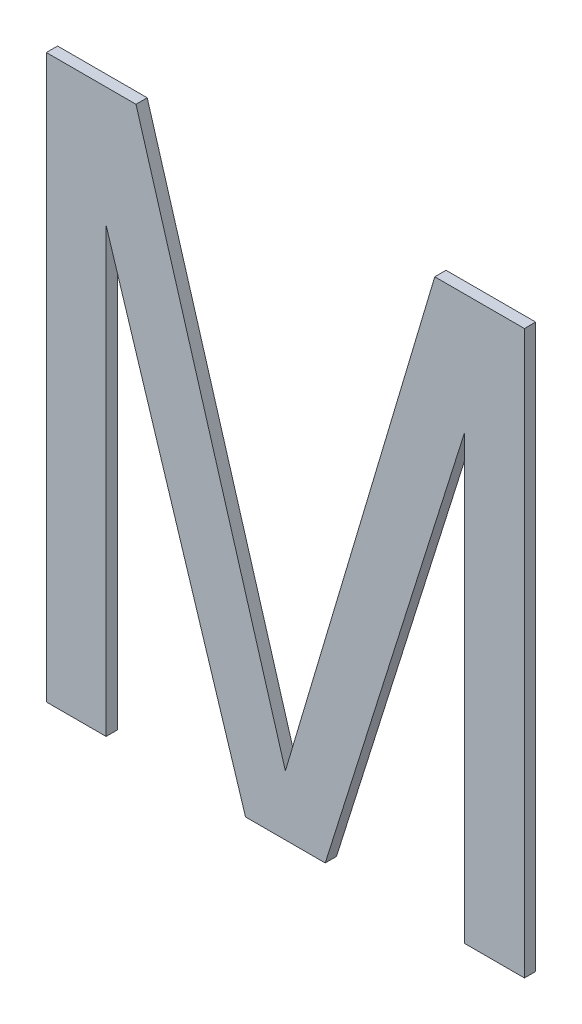
ISO-10303-21;
HEADER;
FILE_DESCRIPTION(('STEP AP214'),'2;1');
FILE_NAME('part.step','',(''),(''),'','','');
FILE_SCHEMA(('AUTOMOTIVE_DESIGN { 1 0 10303 214 1 1 1 1 }'));
ENDSEC;
DATA;
#1=APPLICATION_CONTEXT('core data for automotive mechanical design processes');
#2=APPLICATION_PROTOCOL_DEFINITION('international standard','automotive_design',2000,#1);
#3=PRODUCT_CONTEXT('',#1,'mechanical');
#4=PRODUCT('Part','Part','',(#3));
#5=PRODUCT_RELATED_PRODUCT_CATEGORY('part','',(#4));
#6=PRODUCT_DEFINITION_FORMATION('','',#4);
#7=PRODUCT_DEFINITION_CONTEXT('part definition',#1,'design');
#8=PRODUCT_DEFINITION('design','',#6,#7);
#9=PRODUCT_DEFINITION_SHAPE('','',#8);
#10=(LENGTH_UNIT() NAMED_UNIT(*) SI_UNIT(.MILLI.,.METRE.));
#11=(NAMED_UNIT(*) PLANE_ANGLE_UNIT() SI_UNIT($,.RADIAN.));
#12=(NAMED_UNIT(*) SI_UNIT($,.STERADIAN.) SOLID_ANGLE_UNIT());
#13=UNCERTAINTY_MEASURE_WITH_UNIT(LENGTH_MEASURE(1.E-05),#10,'distance_accuracy_value','');
#14=(GEOMETRIC_REPRESENTATION_CONTEXT(3) GLOBAL_UNCERTAINTY_ASSIGNED_CONTEXT((#13)) GLOBAL_UNIT_ASSIGNED_CONTEXT((#10,
#11,#12)) REPRESENTATION_CONTEXT('',''));
#15=CARTESIAN_POINT('',(0.,0.,0.));
#16=DIRECTION('',(0.,0.,1.));
#17=DIRECTION('',(1.,0.,0.));
#18=AXIS2_PLACEMENT_3D('',#15,#16,#17);
#19=CARTESIAN_POINT('',(179.345164575803,142.200586634191,5.9));
#20=DIRECTION('',(0.,0.,1.));
#21=DIRECTION('',(1.,0.,0.));
#22=AXIS2_PLACEMENT_3D('',#19,#20,#21);
#23=PLANE('',#22);
#24=DIRECTION('',(1.,0.,0.));
#25=VECTOR('',#24,1.);
#26=CARTESIAN_POINT('',(179.345164575803,147.200586634191,5.9));
#27=LINE('',#26,#25);
#28=CARTESIAN_POINT('',(180.142039575803,147.200586634191,5.9));
#29=VERTEX_POINT('',#28);
#30=CARTESIAN_POINT('',(179.345164575803,147.200586634191,5.9));
#31=VERTEX_POINT('',#30);
#32=EDGE_CURVE('E20',#29,#31,#27,.F.);
#33=ORIENTED_EDGE('',*,*,#32,.F.);
#34=DIRECTION('',(0.28492599218727,-0.958549518270235,0.));
#35=VECTOR('',#34,1.);
#36=CARTESIAN_POINT('',(181.470164575803,142.732501538901,5.9));
#37=LINE('',#36,#35);
#38=CARTESIAN_POINT('',(181.470164575803,142.732501538901,5.9));
#39=VERTEX_POINT('',#38);
#40=EDGE_CURVE('E177',#29,#39,#37,.T.);
#41=ORIENTED_EDGE('',*,*,#40,.T.);
#42=DIRECTION('',(0.28492599218727,0.958549518270235,0.));
#43=VECTOR('',#42,1.);
#44=CARTESIAN_POINT('',(182.798289575803,147.200586634191,5.9));
#45=LINE('',#44,#43);
#46=CARTESIAN_POINT('',(182.798289575803,147.200586634191,5.9));
#47=VERTEX_POINT('',#46);
#48=EDGE_CURVE('E172',#39,#47,#45,.T.);
#49=ORIENTED_EDGE('',*,*,#48,.T.);
#50=DIRECTION('',(1.,0.,0.));
#51=VECTOR('',#50,1.);
#52=CARTESIAN_POINT('',(183.595164575803,147.200586634191,5.9));
#53=LINE('',#52,#51);
#54=CARTESIAN_POINT('',(183.595164575803,147.200586634191,5.9));
#55=VERTEX_POINT('',#54);
#56=EDGE_CURVE('E167',#47,#55,#53,.T.);
#57=ORIENTED_EDGE('',*,*,#56,.T.);
#58=DIRECTION('',(0.,1.,0.));
#59=VECTOR('',#58,1.);
#60=CARTESIAN_POINT('',(183.595164575803,142.200586634191,5.9));
#61=LINE('',#60,#59);
#62=CARTESIAN_POINT('',(183.595164575803,142.200586634191,5.9));
#63=VERTEX_POINT('',#62);
#64=EDGE_CURVE('E162',#55,#63,#61,.F.);
#65=ORIENTED_EDGE('',*,*,#64,.T.);
#66=DIRECTION('',(1.,0.,0.));
#67=VECTOR('',#66,1.);
#68=CARTESIAN_POINT('',(183.063914575803,142.200586634191,5.9));
#69=LINE('',#68,#67);
#70=CARTESIAN_POINT('',(183.063914575803,142.200586634191,5.9));
#71=VERTEX_POINT('',#70);
#72=EDGE_CURVE('E157',#63,#71,#69,.F.);
#73=ORIENTED_EDGE('',*,*,#72,.T.);
#74=DIRECTION('',(0.,1.,0.));
#75=VECTOR('',#74,1.);
#76=CARTESIAN_POINT('',(183.063914575803,146.136756973771,5.9));
#77=LINE('',#76,#75);
#78=CARTESIAN_POINT('',(183.063914575803,146.136756973771,5.9));
#79=VERTEX_POINT('',#78);
#80=EDGE_CURVE('E152',#71,#79,#77,.T.);
#81=ORIENTED_EDGE('',*,*,#80,.T.);
#82=DIRECTION('',(-0.300378460265022,-0.953820098660547,0.));
#83=VECTOR('',#82,1.);
#84=CARTESIAN_POINT('',(181.824329891433,142.200586634191,5.9));
#85=LINE('',#84,#83);
#86=CARTESIAN_POINT('',(181.824329891433,142.200586634191,5.9));
#87=VERTEX_POINT('',#86);
#88=EDGE_CURVE('E147',#79,#87,#85,.T.);
#89=ORIENTED_EDGE('',*,*,#88,.T.);
#90=DIRECTION('',(1.,0.,0.));
#91=VECTOR('',#90,1.);
#92=CARTESIAN_POINT('',(181.115999260173,142.200586634191,5.9));
#93=LINE('',#92,#91);
#94=CARTESIAN_POINT('',(181.115999260173,142.200586634191,5.9));
#95=VERTEX_POINT('',#94);
#96=EDGE_CURVE('E142',#87,#95,#93,.F.);
#97=ORIENTED_EDGE('',*,*,#96,.T.);
#98=DIRECTION('',(-0.300378460265025,0.953820098660546,0.));
#99=VECTOR('',#98,1.);
#100=CARTESIAN_POINT('',(179.876414575803,146.136756973771,5.9));
#101=LINE('',#100,#99);
#102=CARTESIAN_POINT('',(179.876414575803,146.136756973771,5.9));
#103=VERTEX_POINT('',#102);
#104=EDGE_CURVE('E138',#95,#103,#101,.T.);
#105=ORIENTED_EDGE('',*,*,#104,.T.);
#106=DIRECTION('',(0.,1.,0.));
#107=VECTOR('',#106,1.);
#108=CARTESIAN_POINT('',(179.876414575803,142.200586634191,5.9));
#109=LINE('',#108,#107);
#110=CARTESIAN_POINT('',(179.876414575803,142.200586634191,5.9));
#111=VERTEX_POINT('',#110);
#112=EDGE_CURVE('E124',#103,#111,#109,.F.);
#113=ORIENTED_EDGE('',*,*,#112,.T.);
#114=DIRECTION('',(1.,0.,0.));
#115=VECTOR('',#114,1.);
#116=CARTESIAN_POINT('',(179.345164575803,142.200586634191,5.9));
#117=LINE('',#116,#115);
#118=CARTESIAN_POINT('',(179.345164575803,142.200586634191,5.9));
#119=VERTEX_POINT('',#118);
#120=EDGE_CURVE('E110',#111,#119,#117,.F.);
#121=ORIENTED_EDGE('',*,*,#120,.T.);
#122=DIRECTION('',(0.,1.,0.));
#123=VECTOR('',#122,1.);
#124=CARTESIAN_POINT('',(179.345164575803,147.200586634191,5.9));
#125=LINE('',#124,#123);
#126=EDGE_CURVE('E116',#119,#31,#125,.T.);
#127=ORIENTED_EDGE('',*,*,#126,.T.);
#128=EDGE_LOOP('',(#33,#41,#49,#57,#65,#73,#81,#89,#97,#105,#113,#121,#127));
#129=FACE_BOUND('',#128,.T.);
#130=ADVANCED_FACE('F17',(#129),#23,.F.);
#131=CARTESIAN_POINT('',(179.345164575803,147.200586634191,6.));
#132=DIRECTION('',(1.,0.,0.));
#133=DIRECTION('',(0.,0.,-1.));
#134=AXIS2_PLACEMENT_3D('',#131,#132,#133);
#135=PLANE('',#134);
#136=DIRECTION('',(0.,0.,1.));
#137=VECTOR('',#136,1.);
#138=CARTESIAN_POINT('',(179.345164575803,142.200586634191,6.));
#139=LINE('',#138,#137);
#140=CARTESIAN_POINT('',(179.345164575803,142.200586634191,6.));
#141=VERTEX_POINT('',#140);
#142=EDGE_CURVE('E118',#119,#141,#139,.T.);
#143=ORIENTED_EDGE('',*,*,#142,.T.);
#144=DIRECTION('',(0.,1.,0.));
#145=VECTOR('',#144,1.);
#146=CARTESIAN_POINT('',(179.345164575803,142.200586634191,6.));
#147=LINE('',#146,#145);
#148=CARTESIAN_POINT('',(179.345164575803,147.200586634191,6.));
#149=VERTEX_POINT('',#148);
#150=EDGE_CURVE('E182',#149,#141,#147,.F.);
#151=ORIENTED_EDGE('',*,*,#150,.F.);
#152=DIRECTION('',(0.,0.,-1.));
#153=VECTOR('',#152,1.);
#154=CARTESIAN_POINT('',(179.345164575803,147.200586634191,6.));
#155=LINE('',#154,#153);
#156=EDGE_CURVE('E121',#149,#31,#155,.T.);
#157=ORIENTED_EDGE('',*,*,#156,.T.);
#158=ORIENTED_EDGE('',*,*,#126,.F.);
#159=EDGE_LOOP('',(#143,#151,#157,#158));
#160=FACE_BOUND('',#159,.T.);
#161=ADVANCED_FACE('F117',(#160),#135,.F.);
#162=CARTESIAN_POINT('',(179.345164575803,142.200586634191,6.));
#163=DIRECTION('',(0.,1.,0.));
#164=DIRECTION('',(0.,0.,1.));
#165=AXIS2_PLACEMENT_3D('',#162,#163,#164);
#166=PLANE('',#165);
#167=DIRECTION('',(0.,0.,1.));
#168=VECTOR('',#167,1.);
#169=CARTESIAN_POINT('',(179.876414575803,142.200586634191,6.));
#170=LINE('',#169,#168);
#171=CARTESIAN_POINT('',(179.876414575803,142.200586634191,6.));
#172=VERTEX_POINT('',#171);
#173=EDGE_CURVE('E126',#111,#172,#170,.T.);
#174=ORIENTED_EDGE('',*,*,#173,.T.);
#175=DIRECTION('',(1.,0.,0.));
#176=VECTOR('',#175,1.);
#177=CARTESIAN_POINT('',(179.345164575803,142.200586634191,6.));
#178=LINE('',#177,#176);
#179=EDGE_CURVE('E130',#141,#172,#178,.T.);
#180=ORIENTED_EDGE('',*,*,#179,.F.);
#181=ORIENTED_EDGE('',*,*,#142,.F.);
#182=ORIENTED_EDGE('',*,*,#120,.F.);
#183=EDGE_LOOP('',(#174,#180,#181,#182));
#184=FACE_BOUND('',#183,.T.);
#185=ADVANCED_FACE('F128',(#184),#166,.F.);
#186=CARTESIAN_POINT('',(179.876414575803,142.200586634191,6.));
#187=DIRECTION('',(-1.,0.,0.));
#188=DIRECTION('',(0.,0.,1.));
#189=AXIS2_PLACEMENT_3D('',#186,#187,#188);
#190=PLANE('',#189);
#191=DIRECTION('',(0.,0.,1.));
#192=VECTOR('',#191,1.);
#193=CARTESIAN_POINT('',(179.876414575803,146.136756973771,6.));
#194=LINE('',#193,#192);
#195=CARTESIAN_POINT('',(179.876414575803,146.136756973771,6.));
#196=VERTEX_POINT('',#195);
#197=EDGE_CURVE('E136',#103,#196,#194,.T.);
#198=ORIENTED_EDGE('',*,*,#197,.T.);
#199=DIRECTION('',(0.,1.,0.));
#200=VECTOR('',#199,1.);
#201=CARTESIAN_POINT('',(179.876414575803,142.200586634191,6.));
#202=LINE('',#201,#200);
#203=EDGE_CURVE('E185',#172,#196,#202,.T.);
#204=ORIENTED_EDGE('',*,*,#203,.F.);
#205=ORIENTED_EDGE('',*,*,#173,.F.);
#206=ORIENTED_EDGE('',*,*,#112,.F.);
#207=EDGE_LOOP('',(#198,#204,#205,#206));
#208=FACE_BOUND('',#207,.T.);
#209=ADVANCED_FACE('F262',(#208),#190,.F.);
#210=CARTESIAN_POINT('',(179.876414575803,146.136756973771,6.));
#211=DIRECTION('',(0.953820098660546,0.300378460265025,0.));
#212=DIRECTION('',(-0.300378460265025,0.953820098660546,0.));
#213=AXIS2_PLACEMENT_3D('',#210,#211,#212);
#214=PLANE('',#213);
#215=DIRECTION('',(0.,0.,1.));
#216=VECTOR('',#215,1.);
#217=CARTESIAN_POINT('',(181.115999260173,142.200586634191,6.));
#218=LINE('',#217,#216);
#219=CARTESIAN_POINT('',(181.115999260173,142.200586634191,6.));
#220=VERTEX_POINT('',#219);
#221=EDGE_CURVE('E140',#95,#220,#218,.T.);
#222=ORIENTED_EDGE('',*,*,#221,.T.);
#223=DIRECTION('',(0.300378460265023,-0.953820098660546,0.));
#224=VECTOR('',#223,1.);
#225=CARTESIAN_POINT('',(179.876414575803,146.136756973771,6.));
#226=LINE('',#225,#224);
#227=EDGE_CURVE('E188',#196,#220,#226,.T.);
#228=ORIENTED_EDGE('',*,*,#227,.F.);
#229=ORIENTED_EDGE('',*,*,#197,.F.);
#230=ORIENTED_EDGE('',*,*,#104,.F.);
#231=EDGE_LOOP('',(#222,#228,#229,#230));
#232=FACE_BOUND('',#231,.T.);
#233=ADVANCED_FACE('F258',(#232),#214,.F.);
#234=CARTESIAN_POINT('',(181.115999260173,142.200586634191,6.));
#235=DIRECTION('',(0.,1.,0.));
#236=DIRECTION('',(0.,0.,1.));
#237=AXIS2_PLACEMENT_3D('',#234,#235,#236);
#238=PLANE('',#237);
#239=DIRECTION('',(0.,0.,1.));
#240=VECTOR('',#239,1.);
#241=CARTESIAN_POINT('',(181.824329891433,142.200586634191,6.));
#242=LINE('',#241,#240);
#243=CARTESIAN_POINT('',(181.824329891433,142.200586634191,6.));
#244=VERTEX_POINT('',#243);
#245=EDGE_CURVE('E145',#87,#244,#242,.T.);
#246=ORIENTED_EDGE('',*,*,#245,.T.);
#247=DIRECTION('',(1.,0.,0.));
#248=VECTOR('',#247,1.);
#249=CARTESIAN_POINT('',(179.345164575803,142.200586634191,6.));
#250=LINE('',#249,#248);
#251=EDGE_CURVE('E191',#220,#244,#250,.T.);
#252=ORIENTED_EDGE('',*,*,#251,.F.);
#253=ORIENTED_EDGE('',*,*,#221,.F.);
#254=ORIENTED_EDGE('',*,*,#96,.F.);
#255=EDGE_LOOP('',(#246,#252,#253,#254));
#256=FACE_BOUND('',#255,.T.);
#257=ADVANCED_FACE('F254',(#256),#238,.F.);
#258=CARTESIAN_POINT('',(181.824329891433,142.200586634191,6.));
#259=DIRECTION('',(-0.953820098660547,0.300378460265022,0.));
#260=DIRECTION('',(-0.300378460265022,-0.953820098660547,0.));
#261=AXIS2_PLACEMENT_3D('',#258,#259,#260);
#262=PLANE('',#261);
#263=DIRECTION('',(0.,0.,-1.));
#264=VECTOR('',#263,1.);
#265=CARTESIAN_POINT('',(183.063914575803,146.136756973771,6.));
#266=LINE('',#265,#264);
#267=CARTESIAN_POINT('',(183.063914575803,146.136756973771,6.));
#268=VERTEX_POINT('',#267);
#269=EDGE_CURVE('E150',#79,#268,#266,.F.);
#270=ORIENTED_EDGE('',*,*,#269,.T.);
#271=DIRECTION('',(0.300378460265023,0.953820098660546,0.));
#272=VECTOR('',#271,1.);
#273=CARTESIAN_POINT('',(181.824329891433,142.200586634191,6.));
#274=LINE('',#273,#272);
#275=EDGE_CURVE('E194',#244,#268,#274,.T.);
#276=ORIENTED_EDGE('',*,*,#275,.F.);
#277=ORIENTED_EDGE('',*,*,#245,.F.);
#278=ORIENTED_EDGE('',*,*,#88,.F.);
#279=EDGE_LOOP('',(#270,#276,#277,#278));
#280=FACE_BOUND('',#279,.T.);
#281=ADVANCED_FACE('F250',(#280),#262,.F.);
#282=CARTESIAN_POINT('',(183.063914575803,146.136756973771,6.));
#283=DIRECTION('',(1.,0.,0.));
#284=DIRECTION('',(0.,0.,-1.));
#285=AXIS2_PLACEMENT_3D('',#282,#283,#284);
#286=PLANE('',#285);
#287=DIRECTION('',(0.,0.,1.));
#288=VECTOR('',#287,1.);
#289=CARTESIAN_POINT('',(183.063914575803,142.200586634191,6.));
#290=LINE('',#289,#288);
#291=CARTESIAN_POINT('',(183.063914575803,142.200586634191,6.));
#292=VERTEX_POINT('',#291);
#293=EDGE_CURVE('E155',#71,#292,#290,.T.);
#294=ORIENTED_EDGE('',*,*,#293,.T.);
#295=DIRECTION('',(0.,1.,0.));
#296=VECTOR('',#295,1.);
#297=CARTESIAN_POINT('',(183.063914575803,142.200586634191,6.));
#298=LINE('',#297,#296);
#299=EDGE_CURVE('E197',#268,#292,#298,.F.);
#300=ORIENTED_EDGE('',*,*,#299,.F.);
#301=ORIENTED_EDGE('',*,*,#269,.F.);
#302=ORIENTED_EDGE('',*,*,#80,.F.);
#303=EDGE_LOOP('',(#294,#300,#301,#302));
#304=FACE_BOUND('',#303,.T.);
#305=ADVANCED_FACE('F246',(#304),#286,.F.);
#306=CARTESIAN_POINT('',(183.063914575803,142.200586634191,6.));
#307=DIRECTION('',(0.,1.,0.));
#308=DIRECTION('',(0.,0.,1.));
#309=AXIS2_PLACEMENT_3D('',#306,#307,#308);
#310=PLANE('',#309);
#311=DIRECTION('',(0.,0.,1.));
#312=VECTOR('',#311,1.);
#313=CARTESIAN_POINT('',(183.595164575803,142.200586634191,6.));
#314=LINE('',#313,#312);
#315=CARTESIAN_POINT('',(183.595164575803,142.200586634191,6.));
#316=VERTEX_POINT('',#315);
#317=EDGE_CURVE('E160',#63,#316,#314,.T.);
#318=ORIENTED_EDGE('',*,*,#317,.T.);
#319=DIRECTION('',(1.,0.,0.));
#320=VECTOR('',#319,1.);
#321=CARTESIAN_POINT('',(179.345164575803,142.200586634191,6.));
#322=LINE('',#321,#320);
#323=EDGE_CURVE('E200',#292,#316,#322,.T.);
#324=ORIENTED_EDGE('',*,*,#323,.F.);
#325=ORIENTED_EDGE('',*,*,#293,.F.);
#326=ORIENTED_EDGE('',*,*,#72,.F.);
#327=EDGE_LOOP('',(#318,#324,#325,#326));
#328=FACE_BOUND('',#327,.T.);
#329=ADVANCED_FACE('F242',(#328),#310,.F.);
#330=CARTESIAN_POINT('',(183.595164575803,142.200586634191,6.));
#331=DIRECTION('',(-1.,0.,0.));
#332=DIRECTION('',(0.,0.,1.));
#333=AXIS2_PLACEMENT_3D('',#330,#331,#332);
#334=PLANE('',#333);
#335=DIRECTION('',(0.,0.,-1.));
#336=VECTOR('',#335,1.);
#337=CARTESIAN_POINT('',(183.595164575803,147.200586634191,6.));
#338=LINE('',#337,#336);
#339=CARTESIAN_POINT('',(183.595164575803,147.200586634191,6.));
#340=VERTEX_POINT('',#339);
#341=EDGE_CURVE('E165',#55,#340,#338,.F.);
#342=ORIENTED_EDGE('',*,*,#341,.T.);
#343=DIRECTION('',(0.,1.,0.));
#344=VECTOR('',#343,1.);
#345=CARTESIAN_POINT('',(183.595164575803,142.200586634191,6.));
#346=LINE('',#345,#344);
#347=EDGE_CURVE('E203',#316,#340,#346,.T.);
#348=ORIENTED_EDGE('',*,*,#347,.F.);
#349=ORIENTED_EDGE('',*,*,#317,.F.);
#350=ORIENTED_EDGE('',*,*,#64,.F.);
#351=EDGE_LOOP('',(#342,#348,#349,#350));
#352=FACE_BOUND('',#351,.T.);
#353=ADVANCED_FACE('F238',(#352),#334,.F.);
#354=CARTESIAN_POINT('',(183.595164575803,147.200586634191,6.));
#355=DIRECTION('',(0.,-1.,0.));
#356=DIRECTION('',(0.,0.,-1.));
#357=AXIS2_PLACEMENT_3D('',#354,#355,#356);
#358=PLANE('',#357);
#359=DIRECTION('',(0.,0.,1.));
#360=VECTOR('',#359,1.);
#361=CARTESIAN_POINT('',(182.798289575803,147.200586634191,6.));
#362=LINE('',#361,#360);
#363=CARTESIAN_POINT('',(182.798289575803,147.200586634191,6.));
#364=VERTEX_POINT('',#363);
#365=EDGE_CURVE('E170',#47,#364,#362,.T.);
#366=ORIENTED_EDGE('',*,*,#365,.T.);
#367=DIRECTION('',(1.,0.,0.));
#368=VECTOR('',#367,1.);
#369=CARTESIAN_POINT('',(179.345164575803,147.200586634191,6.));
#370=LINE('',#369,#368);
#371=EDGE_CURVE('E206',#340,#364,#370,.F.);
#372=ORIENTED_EDGE('',*,*,#371,.F.);
#373=ORIENTED_EDGE('',*,*,#341,.F.);
#374=ORIENTED_EDGE('',*,*,#56,.F.);
#375=EDGE_LOOP('',(#366,#372,#373,#374));
#376=FACE_BOUND('',#375,.T.);
#377=ADVANCED_FACE('F235',(#376),#358,.F.);
#378=CARTESIAN_POINT('',(182.798289575803,147.200586634191,6.));
#379=DIRECTION('',(0.958549518270235,-0.28492599218727,0.));
#380=DIRECTION('',(0.28492599218727,0.958549518270235,0.));
#381=AXIS2_PLACEMENT_3D('',#378,#379,#380);
#382=PLANE('',#381);
#383=DIRECTION('',(0.,0.,1.));
#384=VECTOR('',#383,1.);
#385=CARTESIAN_POINT('',(181.470164575803,142.732501538901,6.));
#386=LINE('',#385,#384);
#387=CARTESIAN_POINT('',(181.470164575803,142.732501538901,6.));
#388=VERTEX_POINT('',#387);
#389=EDGE_CURVE('E175',#39,#388,#386,.T.);
#390=ORIENTED_EDGE('',*,*,#389,.T.);
#391=DIRECTION('',(-0.284925992187267,-0.958549518270236,0.));
#392=VECTOR('',#391,1.);
#393=CARTESIAN_POINT('',(182.798289575803,147.200586634191,6.));
#394=LINE('',#393,#392);
#395=EDGE_CURVE('E209',#364,#388,#394,.T.);
#396=ORIENTED_EDGE('',*,*,#395,.F.);
#397=ORIENTED_EDGE('',*,*,#365,.F.);
#398=ORIENTED_EDGE('',*,*,#48,.F.);
#399=EDGE_LOOP('',(#390,#396,#397,#398));
#400=FACE_BOUND('',#399,.T.);
#401=ADVANCED_FACE('F219',(#400),#382,.F.);
#402=CARTESIAN_POINT('',(181.470164575803,142.732501538901,6.));
#403=DIRECTION('',(-0.958549518270235,-0.28492599218727,0.));
#404=DIRECTION('',(0.28492599218727,-0.958549518270235,0.));
#405=AXIS2_PLACEMENT_3D('',#402,#403,#404);
#406=PLANE('',#405);
#407=DIRECTION('',(0.,0.,-1.));
#408=VECTOR('',#407,1.);
#409=CARTESIAN_POINT('',(180.142039575803,147.200586634191,6.));
#410=LINE('',#409,#408);
#411=CARTESIAN_POINT('',(180.142039575803,147.200586634191,6.));
#412=VERTEX_POINT('',#411);
#413=EDGE_CURVE('E35',#29,#412,#410,.F.);
#414=ORIENTED_EDGE('',*,*,#413,.T.);
#415=DIRECTION('',(-0.284925992187272,0.958549518270234,0.));
#416=VECTOR('',#415,1.);
#417=CARTESIAN_POINT('',(181.470164575803,142.732501538901,6.));
#418=LINE('',#417,#416);
#419=EDGE_CURVE('E26',#388,#412,#418,.T.);
#420=ORIENTED_EDGE('',*,*,#419,.F.);
#421=ORIENTED_EDGE('',*,*,#389,.F.);
#422=ORIENTED_EDGE('',*,*,#40,.F.);
#423=EDGE_LOOP('',(#414,#420,#421,#422));
#424=FACE_BOUND('',#423,.T.);
#425=ADVANCED_FACE('F217',(#424),#406,.F.);
#426=CARTESIAN_POINT('',(180.142039575803,147.200586634191,6.));
#427=DIRECTION('',(0.,-1.,0.));
#428=DIRECTION('',(0.,0.,-1.));
#429=AXIS2_PLACEMENT_3D('',#426,#427,#428);
#430=PLANE('',#429);
#431=ORIENTED_EDGE('',*,*,#156,.F.);
#432=DIRECTION('',(1.,0.,0.));
#433=VECTOR('',#432,1.);
#434=CARTESIAN_POINT('',(179.345164575803,147.200586634191,6.));
#435=LINE('',#434,#433);
#436=EDGE_CURVE('E11',#412,#149,#435,.F.);
#437=ORIENTED_EDGE('',*,*,#436,.F.);
#438=ORIENTED_EDGE('',*,*,#413,.F.);
#439=ORIENTED_EDGE('',*,*,#32,.T.);
#440=EDGE_LOOP('',(#431,#437,#438,#439));
#441=FACE_BOUND('',#440,.T.);
#442=ADVANCED_FACE('F222',(#441),#430,.F.);
#443=CARTESIAN_POINT('',(179.345164575803,142.200586634191,6.));
#444=DIRECTION('',(0.,0.,1.));
#445=DIRECTION('',(1.,0.,0.));
#446=AXIS2_PLACEMENT_3D('',#443,#444,#445);
#447=PLANE('',#446);
#448=ORIENTED_EDGE('',*,*,#419,.T.);
#449=ORIENTED_EDGE('',*,*,#436,.T.);
#450=ORIENTED_EDGE('',*,*,#150,.T.);
#451=ORIENTED_EDGE('',*,*,#179,.T.);
#452=ORIENTED_EDGE('',*,*,#203,.T.);
#453=ORIENTED_EDGE('',*,*,#227,.T.);
#454=ORIENTED_EDGE('',*,*,#251,.T.);
#455=ORIENTED_EDGE('',*,*,#275,.T.);
#456=ORIENTED_EDGE('',*,*,#299,.T.);
#457=ORIENTED_EDGE('',*,*,#323,.T.);
#458=ORIENTED_EDGE('',*,*,#347,.T.);
#459=ORIENTED_EDGE('',*,*,#371,.T.);
#460=ORIENTED_EDGE('',*,*,#395,.T.);
#461=EDGE_LOOP('',(#448,#449,#450,#451,#452,#453,#454,#455,#456,#457,#458,#459,#460));
#462=FACE_BOUND('',#461,.T.);
#463=ADVANCED_FACE('F214',(#462),#447,.T.);
#464=CLOSED_SHELL('',(#130,#161,#185,#209,#233,#257,#281,#305,#329,#353,#377,#401,#425,#442,#463));
#465=MANIFOLD_SOLID_BREP('B1',#464);
#466=ADVANCED_BREP_SHAPE_REPRESENTATION('',(#18,#465),#14);
#467=SHAPE_DEFINITION_REPRESENTATION(#9,#466);
ENDSEC;
END-ISO-10303-21;
